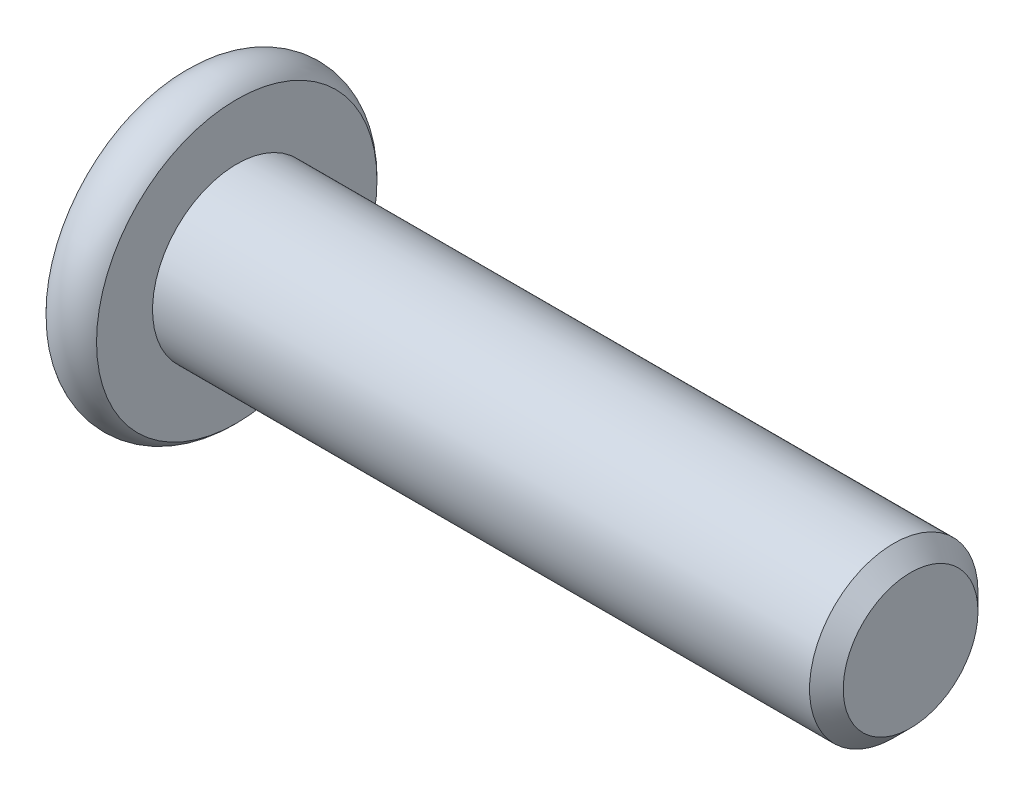
ISO-10303-21;
HEADER;
FILE_DESCRIPTION(('STEP AP214'),'2;1');
FILE_NAME('part.step','',(''),(''),'','','');
FILE_SCHEMA(('AUTOMOTIVE_DESIGN { 1 0 10303 214 1 1 1 1 }'));
ENDSEC;
DATA;
#1=APPLICATION_CONTEXT('core data for automotive mechanical design processes');
#2=APPLICATION_PROTOCOL_DEFINITION('international standard','automotive_design',2000,#1);
#3=PRODUCT_CONTEXT('',#1,'mechanical');
#4=PRODUCT('Part','Part','',(#3));
#5=PRODUCT_RELATED_PRODUCT_CATEGORY('part','',(#4));
#6=PRODUCT_DEFINITION_FORMATION('','',#4);
#7=PRODUCT_DEFINITION_CONTEXT('part definition',#1,'design');
#8=PRODUCT_DEFINITION('design','',#6,#7);
#9=PRODUCT_DEFINITION_SHAPE('','',#8);
#10=(LENGTH_UNIT() NAMED_UNIT(*) SI_UNIT(.MILLI.,.METRE.));
#11=(NAMED_UNIT(*) PLANE_ANGLE_UNIT() SI_UNIT($,.RADIAN.));
#12=(NAMED_UNIT(*) SI_UNIT($,.STERADIAN.) SOLID_ANGLE_UNIT());
#13=UNCERTAINTY_MEASURE_WITH_UNIT(LENGTH_MEASURE(1.E-05),#10,'distance_accuracy_value','');
#14=(GEOMETRIC_REPRESENTATION_CONTEXT(3) GLOBAL_UNCERTAINTY_ASSIGNED_CONTEXT((#13)) GLOBAL_UNIT_ASSIGNED_CONTEXT((#10,
#11,#12)) REPRESENTATION_CONTEXT('',''));
#15=CARTESIAN_POINT('',(0.,0.,0.));
#16=DIRECTION('',(0.,0.,1.));
#17=DIRECTION('',(1.,0.,0.));
#18=AXIS2_PLACEMENT_3D('',#15,#16,#17);
#19=CARTESIAN_POINT('',(-20.,0.,0.));
#20=DIRECTION('',(1.,0.,0.));
#21=DIRECTION('',(0.,0.,-1.));
#22=AXIS2_PLACEMENT_3D('',#19,#20,#21);
#23=CYLINDRICAL_SURFACE('',#22,2.5);
#24=CARTESIAN_POINT('',(-0.5,0.,0.));
#25=DIRECTION('',(1.,0.,0.));
#26=DIRECTION('',(0.,0.,-1.));
#27=AXIS2_PLACEMENT_3D('',#24,#25,#26);
#28=CIRCLE('',#27,2.5);
#29=CARTESIAN_POINT('',(-0.5,0.,-2.5));
#30=VERTEX_POINT('',#29);
#31=EDGE_CURVE('E49',#30,#30,#28,.F.);
#32=ORIENTED_EDGE('',*,*,#31,.T.);
#33=EDGE_LOOP('',(#32));
#34=FACE_BOUND('',#33,.T.);
#35=CARTESIAN_POINT('',(-20.,0.,0.));
#36=DIRECTION('',(-1.,0.,0.));
#37=DIRECTION('',(0.,-1.,0.));
#38=AXIS2_PLACEMENT_3D('',#35,#36,#37);
#39=CIRCLE('',#38,2.5);
#40=CARTESIAN_POINT('',(-20.,-2.50000000000001,0.));
#41=VERTEX_POINT('',#40);
#42=EDGE_CURVE('E134',#41,#41,#39,.F.);
#43=ORIENTED_EDGE('',*,*,#42,.T.);
#44=EDGE_LOOP('',(#43));
#45=FACE_BOUND('',#44,.T.);
#46=ADVANCED_FACE('F35',(#34,#45),#23,.T.);
#47=CARTESIAN_POINT('',(0.,0.,0.));
#48=DIRECTION('',(1.,0.,0.));
#49=DIRECTION('',(0.,0.,-1.));
#50=AXIS2_PLACEMENT_3D('',#47,#48,#49);
#51=PLANE('',#50);
#52=CARTESIAN_POINT('',(0.,0.,0.));
#53=DIRECTION('',(1.,0.,0.));
#54=DIRECTION('',(0.,0.,-1.));
#55=AXIS2_PLACEMENT_3D('',#52,#53,#54);
#56=CIRCLE('',#55,2.);
#57=CARTESIAN_POINT('',(0.,0.,-2.));
#58=VERTEX_POINT('',#57);
#59=EDGE_CURVE('E138',#58,#58,#56,.T.);
#60=ORIENTED_EDGE('',*,*,#59,.T.);
#61=EDGE_LOOP('',(#60));
#62=FACE_BOUND('',#61,.T.);
#63=ADVANCED_FACE('F152',(#62),#51,.T.);
#64=CARTESIAN_POINT('',(0.,0.,0.));
#65=DIRECTION('',(-1.,0.,0.));
#66=DIRECTION('',(0.,0.,1.));
#67=AXIS2_PLACEMENT_3D('',#64,#65,#66);
#68=CONICAL_SURFACE('',#67,2.,0.785398163397446);
#69=ORIENTED_EDGE('',*,*,#31,.F.);
#70=EDGE_LOOP('',(#69));
#71=FACE_BOUND('',#70,.T.);
#72=ORIENTED_EDGE('',*,*,#59,.F.);
#73=EDGE_LOOP('',(#72));
#74=FACE_BOUND('',#73,.T.);
#75=ADVANCED_FACE('F37',(#71,#74),#68,.T.);
#76=CARTESIAN_POINT('',(-21.5,0.,0.));
#77=DIRECTION('',(1.,0.,0.));
#78=DIRECTION('',(0.,1.,0.));
#79=AXIS2_PLACEMENT_3D('',#76,#77,#78);
#80=PLANE('',#79);
#81=CARTESIAN_POINT('',(-21.5,0.,0.));
#82=DIRECTION('',(-1.,0.,0.));
#83=DIRECTION('',(0.,-1.,0.));
#84=AXIS2_PLACEMENT_3D('',#81,#82,#83);
#85=CIRCLE('',#84,1.78205080756887);
#86=CARTESIAN_POINT('',(-21.5,-1.78205080756882,0.));
#87=VERTEX_POINT('',#86);
#88=EDGE_CURVE('E376',#87,#87,#85,.T.);
#89=ORIENTED_EDGE('',*,*,#88,.F.);
#90=EDGE_LOOP('',(#89));
#91=FACE_BOUND('',#90,.T.);
#92=CARTESIAN_POINT('',(-21.5,0.,0.));
#93=DIRECTION('',(-1.,0.,0.));
#94=DIRECTION('',(0.,-1.,0.));
#95=AXIS2_PLACEMENT_3D('',#92,#93,#94);
#96=CIRCLE('',#95,4.16143782776615);
#97=CARTESIAN_POINT('',(-21.5,-4.16143782776615,0.));
#98=VERTEX_POINT('',#97);
#99=EDGE_CURVE('E130',#98,#98,#96,.T.);
#100=ORIENTED_EDGE('',*,*,#99,.T.);
#101=EDGE_LOOP('',(#100));
#102=FACE_BOUND('',#101,.T.);
#103=ADVANCED_FACE('F151',(#91,#102),#80,.F.);
#104=CARTESIAN_POINT('',(-20.75,0.,0.));
#105=DIRECTION('',(-1.,0.,0.));
#106=DIRECTION('',(0.,-1.,0.));
#107=AXIS2_PLACEMENT_3D('',#104,#105,#106);
#108=TOROIDAL_SURFACE('',#107,3.5,1.);
#109=ORIENTED_EDGE('',*,*,#99,.F.);
#110=EDGE_LOOP('',(#109));
#111=FACE_BOUND('',#110,.T.);
#112=CARTESIAN_POINT('',(-20.,0.,0.));
#113=DIRECTION('',(-1.,0.,0.));
#114=DIRECTION('',(0.,-1.,0.));
#115=AXIS2_PLACEMENT_3D('',#112,#113,#114);
#116=CIRCLE('',#115,4.16143782776615);
#117=CARTESIAN_POINT('',(-20.,-4.16143782776615,0.));
#118=VERTEX_POINT('',#117);
#119=EDGE_CURVE('E126',#118,#118,#116,.T.);
#120=ORIENTED_EDGE('',*,*,#119,.T.);
#121=EDGE_LOOP('',(#120));
#122=FACE_BOUND('',#121,.T.);
#123=ADVANCED_FACE('F163',(#111,#122),#108,.T.);
#124=CARTESIAN_POINT('',(-20.,4.16143782776615,0.));
#125=DIRECTION('',(-1.,0.,0.));
#126=DIRECTION('',(0.,-1.,0.));
#127=AXIS2_PLACEMENT_3D('',#124,#125,#126);
#128=PLANE('',#127);
#129=ORIENTED_EDGE('',*,*,#42,.F.);
#130=EDGE_LOOP('',(#129));
#131=FACE_BOUND('',#130,.T.);
#132=ORIENTED_EDGE('',*,*,#119,.F.);
#133=EDGE_LOOP('',(#132));
#134=FACE_BOUND('',#133,.T.);
#135=ADVANCED_FACE('F167',(#131,#134),#128,.F.);
#136=CARTESIAN_POINT('',(-21.5,0.,0.));
#137=DIRECTION('',(-1.,0.,0.));
#138=DIRECTION('',(0.,-1.,0.));
#139=AXIS2_PLACEMENT_3D('',#136,#137,#138);
#140=CONICAL_SURFACE('',#139,1.78205080756887,0.78539816339745);
#141=ORIENTED_EDGE('',*,*,#88,.T.);
#142=EDGE_LOOP('',(#141));
#143=FACE_BOUND('',#142,.T.);
#144=CARTESIAN_POINT('',(-22.0154280856129,-1.74023253176571,1.5));
#145=CARTESIAN_POINT('',(-21.9833811073445,-1.69791724929724,1.5));
#146=CARTESIAN_POINT('',(-21.951644467284,-1.65536760966786,1.5));
#147=CARTESIAN_POINT('',(-21.8889203936152,-1.56970398156679,1.5));
#148=CARTESIAN_POINT('',(-21.8579331482199,-1.52658985542843,1.5));
#149=CARTESIAN_POINT('',(-21.7658461643449,-1.39562626326558,1.5));
#150=CARTESIAN_POINT('',(-21.7061145123021,-1.30679868010571,1.5));
#151=CARTESIAN_POINT('',(-21.5887342891012,-1.1204462264021,1.5));
#152=CARTESIAN_POINT('',(-21.5314082774822,-1.02271587306668,1.5));
#153=CARTESIAN_POINT('',(-21.4264632149759,-0.822357214965221,1.5));
#154=CARTESIAN_POINT('',(-21.3788114236896,-0.719746931701887,1.5));
#155=CARTESIAN_POINT('',(-21.320509988315,-0.565852387095064,1.5));
#156=CARTESIAN_POINT('',(-21.3037990535409,-0.516874191424654,1.5));
#157=CARTESIAN_POINT('',(-21.2743077515089,-0.417723988457495,1.5));
#158=CARTESIAN_POINT('',(-21.2615276514219,-0.367551900263862,1.5));
#159=CARTESIAN_POINT('',(-21.2407784202458,-0.267158299056115,1.5));
#160=CARTESIAN_POINT('',(-21.2327260618259,-0.216954261864852,1.5));
#161=CARTESIAN_POINT('',(-21.221591636834,-0.115994915871319,1.5));
#162=CARTESIAN_POINT('',(-21.2185086886377,-0.0652397064615372,1.5));
#163=CARTESIAN_POINT('',(-21.2175473897404,0.0344222234875568,1.5));
#164=CARTESIAN_POINT('',(-21.2194789216951,0.0833271701100899,1.5));
#165=CARTESIAN_POINT('',(-21.2280175729677,0.180724293127221,1.5));
#166=CARTESIAN_POINT('',(-21.234625142048,0.229216429361728,1.5));
#167=CARTESIAN_POINT('',(-21.2522650626447,0.326258027697005,1.5));
#168=CARTESIAN_POINT('',(-21.263373168201,0.374793507450025,1.5));
#169=CARTESIAN_POINT('',(-21.2894198669595,0.470802295834177,1.5));
#170=CARTESIAN_POINT('',(-21.3043581560035,0.518275688481279,1.5));
#171=CARTESIAN_POINT('',(-21.356839545716,0.667150562065128,1.5));
#172=CARTESIAN_POINT('',(-21.4003351165442,0.766448362426848,1.5));
#173=CARTESIAN_POINT('',(-21.4970587814836,0.960384405673837,1.5));
#174=CARTESIAN_POINT('',(-21.5503217226675,1.05500437383621,1.5));
#175=CARTESIAN_POINT('',(-21.6602258010453,1.23584520321532,1.5));
#176=CARTESIAN_POINT('',(-21.7165682531046,1.3222498694655,1.5));
#177=CARTESIAN_POINT('',(-21.803675572597,1.44954953726474,1.5));
#178=CARTESIAN_POINT('',(-21.8330199906839,1.49143368482424,1.5));
#179=CARTESIAN_POINT('',(-21.8924869182931,1.57462914783245,1.5));
#180=CARTESIAN_POINT('',(-21.9226092115007,1.6159406177258,1.5));
#181=CARTESIAN_POINT('',(-21.9530541181366,1.65701358742554,1.5));
#182=B_SPLINE_CURVE_WITH_KNOTS('',3,(#144,#145,#146,#147,#148,#149,#150,#151,#152,#153,#154,
#155,#156,#157,#158,#159,#160,#161,#162,#163,#164,#165,#166,#167,#168,#169,#170,#171,#172,#173,
#174,#175,#176,#177,#178,#179,#180,#181),.UNSPECIFIED.,.F.,.F.,(4,2,2,2,2,2,2,2,2,2,2,2,2,2,2,2,
2,2,4),(0.,0.159238974218345,0.318517535014529,0.639504781932359,0.979137893799156,
1.31760168934352,1.47272233841618,1.62785352839769,1.7801648653734,1.93244917778272,
2.0790448626029,2.22565464958325,2.37484213303391,2.52401777304032,2.84828365283768,
3.17372975666743,3.4830303053053,3.63644667013902,3.78982082222906),.UNSPECIFIED.);
#183=CARTESIAN_POINT('',(-21.45,-0.866025403784357,1.5));
#184=VERTEX_POINT('',#183);
#185=CARTESIAN_POINT('',(-21.45,0.866025403784521,1.5));
#186=VERTEX_POINT('',#185);
#187=EDGE_CURVE('E104',#184,#186,#182,.T.);
#188=ORIENTED_EDGE('',*,*,#187,.F.);
#189=CARTESIAN_POINT('',(-21.4501154816001,-1.73216627762263,-0.000200000000000827));
#190=CARTESIAN_POINT('',(-21.4203654760673,-1.70239359975907,0.0513677907370736));
#191=CARTESIAN_POINT('',(-21.3923624839103,-1.67212305186347,0.103797917665197));
#192=CARTESIAN_POINT('',(-21.3410892304401,-1.61039789003611,0.210709034055591));
#193=CARTESIAN_POINT('',(-21.3178475050444,-1.57893740312606,0.265200195814655));
#194=CARTESIAN_POINT('',(-21.2780337289922,-1.5154987989798,0.37507908135724));
#195=CARTESIAN_POINT('',(-21.2613615856709,-1.48353684526803,0.43043880909519));
#196=CARTESIAN_POINT('',(-21.2356744568181,-1.41890915196204,0.542377257477138));
#197=CARTESIAN_POINT('',(-21.2266402904788,-1.38624538781111,0.598952556552995));
#198=CARTESIAN_POINT('',(-21.2184890812268,-1.32995210095292,0.696455389516425));
#199=CARTESIAN_POINT('',(-21.2172822529892,-1.30639533311117,0.737256908280449));
#200=CARTESIAN_POINT('',(-21.2193140571623,-1.25932335290186,0.81878796961584));
#201=CARTESIAN_POINT('',(-21.2225536707483,-1.23580815085306,0.859517494314611));
#202=CARTESIAN_POINT('',(-21.2332919859819,-1.1890041497842,0.940584402163395));
#203=CARTESIAN_POINT('',(-21.2407946530187,-1.16571558211713,0.980921384598266));
#204=CARTESIAN_POINT('',(-21.2596516119283,-1.11952932016328,1.06091833691401));
#205=CARTESIAN_POINT('',(-21.2710075570186,-1.0966317980878,1.10057800851618));
#206=CARTESIAN_POINT('',(-21.3047216475927,-1.03798159809691,1.20216313477446));
#207=CARTESIAN_POINT('',(-21.3296218490933,-1.00259267147458,1.26345855370967));
#208=CARTESIAN_POINT('',(-21.3716566532716,-0.950557780604299,1.3535856284633));
#209=CARTESIAN_POINT('',(-21.3864251535591,-0.93341075967707,1.38328513990771));
#210=CARTESIAN_POINT('',(-21.4173105659402,-0.899432101996327,1.44213790138375));
#211=CARTESIAN_POINT('',(-21.4334268341217,-0.882600319285629,1.47129140422064));
#212=CARTESIAN_POINT('',(-21.4501154816001,-0.865909933730519,1.5002));
#213=B_SPLINE_CURVE_WITH_KNOTS('',3,(#189,#190,#191,#192,#193,#194,#195,#196,#197,#198,#199,
#200,#201,#202,#203,#204,#205,#206,#207,#208,#209,#210,#211,#212),.UNSPECIFIED.,.F.,.F.,(4,2,2,
2,2,2,2,2,2,2,2,4),(0.,0.1998291436933,0.400822987382381,0.598623720538169,0.795926240188872,
0.937113067959861,1.0783310557719,1.21968061668219,1.36109089931051,1.58570969637564,
1.69770705470963,1.80965120737194),.UNSPECIFIED.);
#214=CARTESIAN_POINT('',(-21.45,-1.73205080756879,0.));
#215=VERTEX_POINT('',#214);
#216=EDGE_CURVE('E209',#215,#184,#213,.T.);
#217=ORIENTED_EDGE('',*,*,#216,.F.);
#218=CARTESIAN_POINT('',(-21.4501154816001,-0.865909933730518,-1.5002));
#219=CARTESIAN_POINT('',(-21.4203654760673,-0.895682611594083,-1.44863220926292));
#220=CARTESIAN_POINT('',(-21.3923624839103,-0.925953159489683,-1.3962020823348));
#221=CARTESIAN_POINT('',(-21.3410892304401,-0.987678321317044,-1.2892909659444));
#222=CARTESIAN_POINT('',(-21.3178475050444,-1.0191388082271,-1.23479980418533));
#223=CARTESIAN_POINT('',(-21.2780337289922,-1.08257741237337,-1.12492091864274));
#224=CARTESIAN_POINT('',(-21.2613615856709,-1.11453936608514,-1.06956119090479));
#225=CARTESIAN_POINT('',(-21.2356744568181,-1.17916705939113,-0.95762274252284));
#226=CARTESIAN_POINT('',(-21.2266402904788,-1.21183082354206,-0.901047443446981));
#227=CARTESIAN_POINT('',(-21.2184890812268,-1.26812411040025,-0.803544610483548));
#228=CARTESIAN_POINT('',(-21.2172822529892,-1.291680878242,-0.762743091719523));
#229=CARTESIAN_POINT('',(-21.2193140571623,-1.33875285845131,-0.681212030384133));
#230=CARTESIAN_POINT('',(-21.2225536707483,-1.36226806050011,-0.640482505685362));
#231=CARTESIAN_POINT('',(-21.2332919859819,-1.40907206156897,-0.559415597836578));
#232=CARTESIAN_POINT('',(-21.2407946530187,-1.43236062923604,-0.519078615401706));
#233=CARTESIAN_POINT('',(-21.2596516119283,-1.47854689118989,-0.439081663085965));
#234=CARTESIAN_POINT('',(-21.2710075570186,-1.50144441326537,-0.399421991483789));
#235=CARTESIAN_POINT('',(-21.3047216475926,-1.56009461325625,-0.297836865225513));
#236=CARTESIAN_POINT('',(-21.3296218490933,-1.59548353987858,-0.236541446290309));
#237=CARTESIAN_POINT('',(-21.3716566532716,-1.64751843074886,-0.146414371536686));
#238=CARTESIAN_POINT('',(-21.3864251535591,-1.66466545167609,-0.116714860092282));
#239=CARTESIAN_POINT('',(-21.4173105659401,-1.69864410935683,-0.0578620986162497));
#240=CARTESIAN_POINT('',(-21.4334268341217,-1.71547589206752,-0.0287085957793635));
#241=CARTESIAN_POINT('',(-21.4501154816001,-1.73216627762263,0.000199999999999412));
#242=B_SPLINE_CURVE_WITH_KNOTS('',3,(#218,#219,#220,#221,#222,#223,#224,#225,#226,#227,#228,
#229,#230,#231,#232,#233,#234,#235,#236,#237,#238,#239,#240,#241),.UNSPECIFIED.,.F.,.F.,(4,2,2,
2,2,2,2,2,2,2,2,4),(0.,0.199829143693309,0.400822987382399,0.598623720538195,0.795926240188908,
0.937113067959897,1.07833105577194,1.21968061668223,1.36109089931055,1.58570969637566,
1.69770705470964,1.80965120737194),.UNSPECIFIED.);
#243=CARTESIAN_POINT('',(-21.45,-0.866025403784356,-1.5));
#244=VERTEX_POINT('',#243);
#245=EDGE_CURVE('E204',#244,#215,#242,.T.);
#246=ORIENTED_EDGE('',*,*,#245,.F.);
#247=CARTESIAN_POINT('',(-22.0154280857207,-1.74023253190804,-1.5));
#248=CARTESIAN_POINT('',(-21.9833811074481,-1.69791724943556,-1.5));
#249=CARTESIAN_POINT('',(-21.9516444673835,-1.65536760980215,-1.5));
#250=CARTESIAN_POINT('',(-21.8889203937065,-1.56970398169299,-1.5));
#251=CARTESIAN_POINT('',(-21.857933148307,-1.52658985555056,-1.5));
#252=CARTESIAN_POINT('',(-21.7658461644196,-1.39562626337526,-1.5));
#253=CARTESIAN_POINT('',(-21.7061145123685,-1.30679868020693,-1.5));
#254=CARTESIAN_POINT('',(-21.5887342891506,-1.12044622648487,-1.5));
#255=CARTESIAN_POINT('',(-21.5314082775229,-1.02271587313941,-1.5));
#256=CARTESIAN_POINT('',(-21.4264632150005,-0.82235721501701,-1.5));
#257=CARTESIAN_POINT('',(-21.3788114237067,-0.719746931742787,-1.5));
#258=CARTESIAN_POINT('',(-21.3205099883267,-0.565852387127782,-1.5));
#259=CARTESIAN_POINT('',(-21.3037990535528,-0.516874191460818,-1.5));
#260=CARTESIAN_POINT('',(-21.2743077515206,-0.417723988500667,-1.5));
#261=CARTESIAN_POINT('',(-21.2615276514332,-0.367551900310598,-1.5));
#262=CARTESIAN_POINT('',(-21.2407784202553,-0.267158299109861,-1.5));
#263=CARTESIAN_POINT('',(-21.2327260618342,-0.216954261922043,-1.5));
#264=CARTESIAN_POINT('',(-21.2215916368391,-0.11599491593529,-1.5));
#265=CARTESIAN_POINT('',(-21.2185086886407,-0.0652397065288419,-1.5));
#266=CARTESIAN_POINT('',(-21.2175473897388,0.0344222234141835,-1.5));
#267=CARTESIAN_POINT('',(-21.219478921691,0.0833271700339729,-1.5));
#268=CARTESIAN_POINT('',(-21.228017572958,0.180724293045896,-1.5));
#269=CARTESIAN_POINT('',(-21.2346251420354,0.229216429277938,-1.5));
#270=CARTESIAN_POINT('',(-21.2522650626259,0.326258027608351,-1.5));
#271=CARTESIAN_POINT('',(-21.2633731681789,0.374793507358977,-1.5));
#272=CARTESIAN_POINT('',(-21.2894198669309,0.470802295738578,-1.5));
#273=CARTESIAN_POINT('',(-21.3043581559716,0.518275688383522,-1.5));
#274=CARTESIAN_POINT('',(-21.3568395456685,0.667150561946175,-1.5));
#275=CARTESIAN_POINT('',(-21.4003351164824,0.76644836228992,-1.5));
#276=CARTESIAN_POINT('',(-21.4970587813916,0.960384405502337,-1.5));
#277=CARTESIAN_POINT('',(-21.5503217225595,1.05500437364812,-1.5));
#278=CARTESIAN_POINT('',(-21.6602258009069,1.23584520299742,-1.5));
#279=CARTESIAN_POINT('',(-21.7165682529518,1.32224986923427,-1.5));
#280=CARTESIAN_POINT('',(-21.8036755724226,1.44954953701379,-1.5));
#281=CARTESIAN_POINT('',(-21.8330199905024,1.49143368456681,-1.5));
#282=CARTESIAN_POINT('',(-21.8924869180973,1.57462914756211,-1.5));
#283=CARTESIAN_POINT('',(-21.9226092112979,1.61594061744903,-1.5));
#284=CARTESIAN_POINT('',(-21.9530541179266,1.65701358714234,-1.5));
#285=B_SPLINE_CURVE_WITH_KNOTS('',3,(#247,#248,#249,#250,#251,#252,#253,#254,#255,#256,#257,
#258,#259,#260,#261,#262,#263,#264,#265,#266,#267,#268,#269,#270,#271,#272,#273,#274,#275,#276,
#277,#278,#279,#280,#281,#282,#283,#284),.UNSPECIFIED.,.F.,.F.,(4,2,2,2,2,2,2,2,2,2,2,2,2,2,2,2,
2,2,4),(0.,0.159238974235473,0.318517535048788,0.63950478200152,0.979137893907475,
1.31760168949062,1.4727223385533,1.62785352852483,1.78016486549098,1.93244917789075,
2.07904486270244,2.22565464967428,2.37484213311578,2.52401777311302,2.84828365284403,
3.17372975660699,3.48303030518774,3.63644666999328,3.78982082205515),.UNSPECIFIED.);
#286=CARTESIAN_POINT('',(-21.45,0.866025403784482,-1.5));
#287=VERTEX_POINT('',#286);
#288=EDGE_CURVE('E56',#287,#244,#285,.F.);
#289=ORIENTED_EDGE('',*,*,#288,.F.);
#290=CARTESIAN_POINT('',(-21.4501154816001,1.7321662776228,0.000200000000000631));
#291=CARTESIAN_POINT('',(-21.4203654760674,1.70239359975923,-0.0513677907370775));
#292=CARTESIAN_POINT('',(-21.3923624839104,1.67212305186363,-0.103797917665205));
#293=CARTESIAN_POINT('',(-21.3410892304402,1.61039789003626,-0.210709034055606));
#294=CARTESIAN_POINT('',(-21.3178475050444,1.57893740312621,-0.265200195814673));
#295=CARTESIAN_POINT('',(-21.2780337289922,1.51549879897993,-0.375079081357266));
#296=CARTESIAN_POINT('',(-21.2613615856709,1.48353684526816,-0.43043880909522));
#297=CARTESIAN_POINT('',(-21.2356744568181,1.41890915196217,-0.542377257477176));
#298=CARTESIAN_POINT('',(-21.2266402904789,1.38624538781123,-0.598952556553036));
#299=CARTESIAN_POINT('',(-21.2184890812269,1.32995210095304,-0.696455389516471));
#300=CARTESIAN_POINT('',(-21.2172822529892,1.30639533311128,-0.737256908280496));
#301=CARTESIAN_POINT('',(-21.2193140571623,1.25932335290198,-0.818787969615889));
#302=CARTESIAN_POINT('',(-21.2225536707483,1.23580815085317,-0.859517494314661));
#303=CARTESIAN_POINT('',(-21.233291985982,1.1890041497843,-0.940584402163447));
#304=CARTESIAN_POINT('',(-21.2407946530188,1.16571558211723,-0.98092138459832));
#305=CARTESIAN_POINT('',(-21.2596516119283,1.11952932016339,-1.06091833691406));
#306=CARTESIAN_POINT('',(-21.2710075570186,1.0966317980879,-1.10057800851624));
#307=CARTESIAN_POINT('',(-21.3047216475927,1.03798159809702,-1.20216313477451));
#308=CARTESIAN_POINT('',(-21.3296218490934,1.00259267147469,-1.26345855370971));
#309=CARTESIAN_POINT('',(-21.3716566532716,0.950557780604414,-1.35358562846333));
#310=CARTESIAN_POINT('',(-21.3864251535591,0.933410759677188,-1.38328513990773));
#311=CARTESIAN_POINT('',(-21.4173105659402,0.899432101996449,-1.44213790138376));
#312=CARTESIAN_POINT('',(-21.4334268341217,0.882600319285753,-1.47129140422064));
#313=CARTESIAN_POINT('',(-21.4501154816001,0.865909933730644,-1.5002));
#314=B_SPLINE_CURVE_WITH_KNOTS('',3,(#290,#291,#292,#293,#294,#295,#296,#297,#298,#299,#300,
#301,#302,#303,#304,#305,#306,#307,#308,#309,#310,#311,#312,#313),.UNSPECIFIED.,.F.,.F.,(4,2,2,
2,2,2,2,2,2,2,2,4),(0.,0.199829143693318,0.400822987382415,0.598623720538219,0.795926240188938,
0.937113067959932,1.07833105577198,1.21968061668227,1.3610908993106,1.58570969637569,
1.69770705470966,1.80965120737196),.UNSPECIFIED.);
#315=CARTESIAN_POINT('',(-21.45,1.73205080756896,0.));
#316=VERTEX_POINT('',#315);
#317=EDGE_CURVE('E11',#316,#287,#314,.T.);
#318=ORIENTED_EDGE('',*,*,#317,.F.);
#319=CARTESIAN_POINT('',(-21.4501154816001,0.865909933730683,1.5002));
#320=CARTESIAN_POINT('',(-21.4203654760674,0.895682611594248,1.44863220926292));
#321=CARTESIAN_POINT('',(-21.3923624839103,0.925953159489847,1.3962020823348));
#322=CARTESIAN_POINT('',(-21.3410892304402,0.987678321317204,1.28929096594441));
#323=CARTESIAN_POINT('',(-21.3178475050444,1.01913880822725,1.23479980418534));
#324=CARTESIAN_POINT('',(-21.2780337289923,1.08257741237352,1.12492091864276));
#325=CARTESIAN_POINT('',(-21.2613615856709,1.11453936608529,1.06956119090481));
#326=CARTESIAN_POINT('',(-21.2356744568181,1.17916705939128,0.957622742522858));
#327=CARTESIAN_POINT('',(-21.2266402904789,1.21183082354221,0.901047443447));
#328=CARTESIAN_POINT('',(-21.2184890812269,1.2681241104004,0.803544610483568));
#329=CARTESIAN_POINT('',(-21.2172822529893,1.29168087824215,0.762743091719542));
#330=CARTESIAN_POINT('',(-21.2193140571623,1.33875285845146,0.681212030384148));
#331=CARTESIAN_POINT('',(-21.2225536707483,1.36226806050026,0.640482505685376));
#332=CARTESIAN_POINT('',(-21.233291985982,1.40907206156913,0.559415597836588));
#333=CARTESIAN_POINT('',(-21.2407946530188,1.4323606292362,0.519078615401716));
#334=CARTESIAN_POINT('',(-21.2596516119283,1.47854689119004,0.439081663085971));
#335=CARTESIAN_POINT('',(-21.2710075570186,1.50144441326553,0.399421991483793));
#336=CARTESIAN_POINT('',(-21.3047216475927,1.56009461325641,0.297836865225515));
#337=CARTESIAN_POINT('',(-21.3296218490934,1.59548353987874,0.236541446290312));
#338=CARTESIAN_POINT('',(-21.3716566532716,1.64751843074902,0.146414371536688));
#339=CARTESIAN_POINT('',(-21.3864251535591,1.66466545167625,0.116714860092283));
#340=CARTESIAN_POINT('',(-21.4173105659402,1.69864410935699,0.0578620986162498));
#341=CARTESIAN_POINT('',(-21.4334268341218,1.71547589206769,0.0287085957793632));
#342=CARTESIAN_POINT('',(-21.4501154816001,1.7321662776228,-0.000199999999999863));
#343=B_SPLINE_CURVE_WITH_KNOTS('',3,(#319,#320,#321,#322,#323,#324,#325,#326,#327,#328,#329,
#330,#331,#332,#333,#334,#335,#336,#337,#338,#339,#340,#341,#342),.UNSPECIFIED.,.F.,.F.,(4,2,2,
2,2,2,2,2,2,2,2,4),(0.,0.1998291436933,0.400822987382378,0.598623720538167,0.795926240188873,
0.937113067959867,1.07833105577192,1.21968061668221,1.36109089931054,1.58570969637565,
1.69770705470963,1.80965120737193),.UNSPECIFIED.);
#344=EDGE_CURVE('E94',#186,#316,#343,.T.);
#345=ORIENTED_EDGE('',*,*,#344,.F.);
#346=EDGE_LOOP('',(#188,#217,#246,#289,#318,#345));
#347=FACE_BOUND('',#346,.T.);
#348=ADVANCED_FACE('F93',(#143,#347),#140,.F.);
#349=CARTESIAN_POINT('',(-19.2,0.,0.));
#350=DIRECTION('',(-1.,0.,0.));
#351=DIRECTION('',(0.,-1.,0.));
#352=AXIS2_PLACEMENT_3D('',#349,#350,#351);
#353=PLANE('',#352);
#354=DIRECTION('',(0.,0.5,-0.866025403784438));
#355=VECTOR('',#354,1.);
#356=CARTESIAN_POINT('',(-19.2,0.866025403784513,1.5));
#357=LINE('',#356,#355);
#358=CARTESIAN_POINT('',(-19.2,0.866025403784513,1.5));
#359=VERTEX_POINT('',#358);
#360=CARTESIAN_POINT('',(-19.2,1.73205080756895,0.));
#361=VERTEX_POINT('',#360);
#362=EDGE_CURVE('E103',#359,#361,#357,.T.);
#363=ORIENTED_EDGE('',*,*,#362,.T.);
#364=DIRECTION('',(0.,-0.500000000000017,-0.866025403784429));
#365=VECTOR('',#364,1.);
#366=CARTESIAN_POINT('',(-19.2,1.73205080756895,0.));
#367=LINE('',#366,#365);
#368=CARTESIAN_POINT('',(-19.2,0.866025403784474,-1.5));
#369=VERTEX_POINT('',#368);
#370=EDGE_CURVE('E108',#361,#369,#367,.T.);
#371=ORIENTED_EDGE('',*,*,#370,.T.);
#372=DIRECTION('',(0.,-1.,0.));
#373=VECTOR('',#372,1.);
#374=CARTESIAN_POINT('',(-19.2,0.866025403784474,-1.5));
#375=LINE('',#374,#373);
#376=CARTESIAN_POINT('',(-19.2,-0.866025403784365,-1.5));
#377=VERTEX_POINT('',#376);
#378=EDGE_CURVE('E235',#369,#377,#375,.T.);
#379=ORIENTED_EDGE('',*,*,#378,.T.);
#380=DIRECTION('',(0.,-0.5,0.866025403784438));
#381=VECTOR('',#380,1.);
#382=CARTESIAN_POINT('',(-19.2,-0.866025403784365,-1.5));
#383=LINE('',#382,#381);
#384=CARTESIAN_POINT('',(-19.2,-1.7320508075688,0.));
#385=VERTEX_POINT('',#384);
#386=EDGE_CURVE('E240',#377,#385,#383,.T.);
#387=ORIENTED_EDGE('',*,*,#386,.T.);
#388=DIRECTION('',(0.,0.5,0.866025403784439));
#389=VECTOR('',#388,1.);
#390=CARTESIAN_POINT('',(-19.2,-1.7320508075688,0.));
#391=LINE('',#390,#389);
#392=CARTESIAN_POINT('',(-19.2,-0.866025403784366,1.5));
#393=VERTEX_POINT('',#392);
#394=EDGE_CURVE('E122',#385,#393,#391,.T.);
#395=ORIENTED_EDGE('',*,*,#394,.T.);
#396=DIRECTION('',(0.,1.,0.));
#397=VECTOR('',#396,1.);
#398=CARTESIAN_POINT('',(-19.2,-0.866025403784366,1.5));
#399=LINE('',#398,#397);
#400=EDGE_CURVE('E112',#393,#359,#399,.T.);
#401=ORIENTED_EDGE('',*,*,#400,.T.);
#402=EDGE_LOOP('',(#363,#371,#379,#387,#395,#401));
#403=FACE_BOUND('',#402,.T.);
#404=ADVANCED_FACE('F191',(#403),#353,.T.);
#405=CARTESIAN_POINT('',(-19.2,1.73205080756895,0.));
#406=DIRECTION('',(0.,0.866025403784429,-0.500000000000017));
#407=DIRECTION('',(0.,0.500000000000017,0.866025403784429));
#408=AXIS2_PLACEMENT_3D('',#405,#406,#407);
#409=PLANE('',#408);
#410=DIRECTION('',(-1.,0.,0.));
#411=VECTOR('',#410,1.);
#412=CARTESIAN_POINT('',(-19.2,1.73205080756895,0.));
#413=LINE('',#412,#411);
#414=EDGE_CURVE('E100',#361,#316,#413,.T.);
#415=ORIENTED_EDGE('',*,*,#414,.T.);
#416=ORIENTED_EDGE('',*,*,#317,.T.);
#417=DIRECTION('',(-1.,0.,0.));
#418=VECTOR('',#417,1.);
#419=CARTESIAN_POINT('',(-19.2,0.866025403784474,-1.5));
#420=LINE('',#419,#418);
#421=EDGE_CURVE('E111',#369,#287,#420,.T.);
#422=ORIENTED_EDGE('',*,*,#421,.F.);
#423=ORIENTED_EDGE('',*,*,#370,.F.);
#424=EDGE_LOOP('',(#415,#416,#422,#423));
#425=FACE_BOUND('',#424,.T.);
#426=ADVANCED_FACE('F106',(#425),#409,.F.);
#427=CARTESIAN_POINT('',(-19.2,0.866025403784474,-1.5));
#428=DIRECTION('',(0.,0.,-1.));
#429=DIRECTION('',(0.,1.,0.));
#430=AXIS2_PLACEMENT_3D('',#427,#428,#429);
#431=PLANE('',#430);
#432=ORIENTED_EDGE('',*,*,#421,.T.);
#433=ORIENTED_EDGE('',*,*,#288,.T.);
#434=DIRECTION('',(-1.,0.,0.));
#435=VECTOR('',#434,1.);
#436=CARTESIAN_POINT('',(-19.2,-0.866025403784365,-1.5));
#437=LINE('',#436,#435);
#438=EDGE_CURVE('E118',#377,#244,#437,.T.);
#439=ORIENTED_EDGE('',*,*,#438,.F.);
#440=ORIENTED_EDGE('',*,*,#378,.F.);
#441=EDGE_LOOP('',(#432,#433,#439,#440));
#442=FACE_BOUND('',#441,.T.);
#443=ADVANCED_FACE('F224',(#442),#431,.F.);
#444=CARTESIAN_POINT('',(-19.2,-0.866025403784365,-1.5));
#445=DIRECTION('',(0.,-0.866025403784439,-0.5));
#446=DIRECTION('',(0.,0.5,-0.866025403784439));
#447=AXIS2_PLACEMENT_3D('',#444,#445,#446);
#448=PLANE('',#447);
#449=ORIENTED_EDGE('',*,*,#438,.T.);
#450=ORIENTED_EDGE('',*,*,#245,.T.);
#451=DIRECTION('',(-1.,0.,0.));
#452=VECTOR('',#451,1.);
#453=CARTESIAN_POINT('',(-19.2,-1.7320508075688,0.));
#454=LINE('',#453,#452);
#455=EDGE_CURVE('E256',#385,#215,#454,.T.);
#456=ORIENTED_EDGE('',*,*,#455,.F.);
#457=ORIENTED_EDGE('',*,*,#386,.F.);
#458=EDGE_LOOP('',(#449,#450,#456,#457));
#459=FACE_BOUND('',#458,.T.);
#460=ADVANCED_FACE('F219',(#459),#448,.F.);
#461=CARTESIAN_POINT('',(-19.2,-1.7320508075688,0.));
#462=DIRECTION('',(0.,-0.866025403784439,0.5));
#463=DIRECTION('',(0.,-0.5,-0.866025403784439));
#464=AXIS2_PLACEMENT_3D('',#461,#462,#463);
#465=PLANE('',#464);
#466=ORIENTED_EDGE('',*,*,#455,.T.);
#467=ORIENTED_EDGE('',*,*,#216,.T.);
#468=DIRECTION('',(-1.,0.,0.));
#469=VECTOR('',#468,1.);
#470=CARTESIAN_POINT('',(-19.2,-0.866025403784366,1.5));
#471=LINE('',#470,#469);
#472=EDGE_CURVE('E252',#393,#184,#471,.T.);
#473=ORIENTED_EDGE('',*,*,#472,.F.);
#474=ORIENTED_EDGE('',*,*,#394,.F.);
#475=EDGE_LOOP('',(#466,#467,#473,#474));
#476=FACE_BOUND('',#475,.T.);
#477=ADVANCED_FACE('F216',(#476),#465,.F.);
#478=CARTESIAN_POINT('',(-19.2,-0.866025403784366,1.5));
#479=DIRECTION('',(0.,0.,1.));
#480=DIRECTION('',(1.,0.,0.));
#481=AXIS2_PLACEMENT_3D('',#478,#479,#480);
#482=PLANE('',#481);
#483=ORIENTED_EDGE('',*,*,#472,.T.);
#484=ORIENTED_EDGE('',*,*,#187,.T.);
#485=DIRECTION('',(-1.,0.,0.));
#486=VECTOR('',#485,1.);
#487=CARTESIAN_POINT('',(-19.2,0.866025403784513,1.5));
#488=LINE('',#487,#486);
#489=EDGE_CURVE('E63',#359,#186,#488,.T.);
#490=ORIENTED_EDGE('',*,*,#489,.F.);
#491=ORIENTED_EDGE('',*,*,#400,.F.);
#492=EDGE_LOOP('',(#483,#484,#490,#491));
#493=FACE_BOUND('',#492,.T.);
#494=ADVANCED_FACE('F174',(#493),#482,.F.);
#495=CARTESIAN_POINT('',(-19.2,0.866025403784513,1.5));
#496=DIRECTION('',(0.,0.866025403784439,0.5));
#497=DIRECTION('',(0.,-0.5,0.866025403784439));
#498=AXIS2_PLACEMENT_3D('',#495,#496,#497);
#499=PLANE('',#498);
#500=ORIENTED_EDGE('',*,*,#489,.T.);
#501=ORIENTED_EDGE('',*,*,#344,.T.);
#502=ORIENTED_EDGE('',*,*,#414,.F.);
#503=ORIENTED_EDGE('',*,*,#362,.F.);
#504=EDGE_LOOP('',(#500,#501,#502,#503));
#505=FACE_BOUND('',#504,.T.);
#506=ADVANCED_FACE('F99',(#505),#499,.F.);
#507=CLOSED_SHELL('',(#46,#63,#75,#103,#123,#135,#348,#404,#426,#443,#460,#477,#494,#506));
#508=MANIFOLD_SOLID_BREP('B2',#507);
#509=ADVANCED_BREP_SHAPE_REPRESENTATION('',(#18,#508),#14);
#510=SHAPE_DEFINITION_REPRESENTATION(#9,#509);
ENDSEC;
END-ISO-10303-21;
